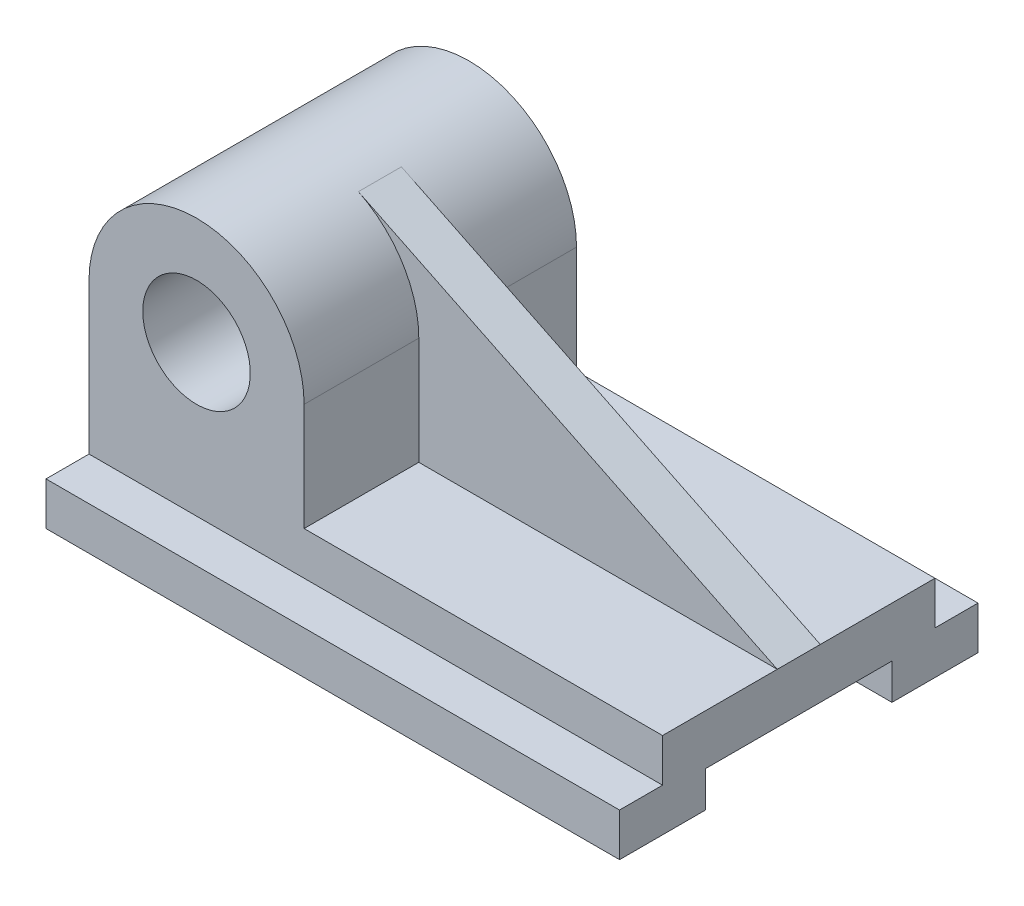
ISO-10303-21;
HEADER;
FILE_DESCRIPTION(('STEP AP214'),'2;1');
FILE_NAME('part.step','',(''),(''),'','','');
FILE_SCHEMA(('AUTOMOTIVE_DESIGN { 1 0 10303 214 1 1 1 1 }'));
ENDSEC;
DATA;
#1=APPLICATION_CONTEXT('core data for automotive mechanical design processes');
#2=APPLICATION_PROTOCOL_DEFINITION('international standard','automotive_design',2000,#1);
#3=PRODUCT_CONTEXT('',#1,'mechanical');
#4=PRODUCT('Part','Part','',(#3));
#5=PRODUCT_RELATED_PRODUCT_CATEGORY('part','',(#4));
#6=PRODUCT_DEFINITION_FORMATION('','',#4);
#7=PRODUCT_DEFINITION_CONTEXT('part definition',#1,'design');
#8=PRODUCT_DEFINITION('design','',#6,#7);
#9=PRODUCT_DEFINITION_SHAPE('','',#8);
#10=(LENGTH_UNIT() NAMED_UNIT(*) SI_UNIT(.MILLI.,.METRE.));
#11=(NAMED_UNIT(*) PLANE_ANGLE_UNIT() SI_UNIT($,.RADIAN.));
#12=(NAMED_UNIT(*) SI_UNIT($,.STERADIAN.) SOLID_ANGLE_UNIT());
#13=UNCERTAINTY_MEASURE_WITH_UNIT(LENGTH_MEASURE(1.E-05),#10,'distance_accuracy_value','');
#14=(GEOMETRIC_REPRESENTATION_CONTEXT(3) GLOBAL_UNCERTAINTY_ASSIGNED_CONTEXT((#13)) GLOBAL_UNIT_ASSIGNED_CONTEXT((#10,
#11,#12)) REPRESENTATION_CONTEXT('',''));
#15=CARTESIAN_POINT('',(0.,0.,0.));
#16=DIRECTION('',(0.,0.,1.));
#17=DIRECTION('',(1.,0.,0.));
#18=AXIS2_PLACEMENT_3D('',#15,#16,#17);
#19=CARTESIAN_POINT('',(-160.,19.,0.));
#20=DIRECTION('',(0.,-1.,0.));
#21=DIRECTION('',(0.,0.,-1.));
#22=AXIS2_PLACEMENT_3D('',#19,#20,#21);
#23=PLANE('',#22);
#24=DIRECTION('',(-1.,0.,0.));
#25=VECTOR('',#24,1.);
#26=CARTESIAN_POINT('',(-160.,19.,-6.));
#27=LINE('',#26,#25);
#28=CARTESIAN_POINT('',(0.,19.,-6.));
#29=VERTEX_POINT('',#28);
#30=CARTESIAN_POINT('',(-100.,19.,-6.));
#31=VERTEX_POINT('',#30);
#32=EDGE_CURVE('E203',#29,#31,#27,.T.);
#33=ORIENTED_EDGE('',*,*,#32,.F.);
#34=DIRECTION('',(0.,0.,-1.));
#35=VECTOR('',#34,1.);
#36=CARTESIAN_POINT('',(0.,19.,0.));
#37=LINE('',#36,#35);
#38=CARTESIAN_POINT('',(0.,19.,-38.));
#39=VERTEX_POINT('',#38);
#40=EDGE_CURVE('E209',#29,#39,#37,.T.);
#41=ORIENTED_EDGE('',*,*,#40,.T.);
#42=DIRECTION('',(1.,0.,0.));
#43=VECTOR('',#42,1.);
#44=CARTESIAN_POINT('',(-160.,19.,-38.));
#45=LINE('',#44,#43);
#46=CARTESIAN_POINT('',(-100.,19.,-38.));
#47=VERTEX_POINT('',#46);
#48=EDGE_CURVE('E251',#47,#39,#45,.T.);
#49=ORIENTED_EDGE('',*,*,#48,.F.);
#50=DIRECTION('',(0.,0.,-1.));
#51=VECTOR('',#50,1.);
#52=CARTESIAN_POINT('',(-100.,19.,38.));
#53=LINE('',#52,#51);
#54=EDGE_CURVE('E211',#31,#47,#53,.T.);
#55=ORIENTED_EDGE('',*,*,#54,.F.);
#56=EDGE_LOOP('',(#33,#41,#49,#55));
#57=FACE_BOUND('',#56,.T.);
#58=ADVANCED_FACE('F61',(#57),#23,.F.);
#59=CARTESIAN_POINT('',(-100.,19.,38.));
#60=DIRECTION('',(-1.,0.,0.));
#61=DIRECTION('',(0.,0.,1.));
#62=AXIS2_PLACEMENT_3D('',#59,#60,#61);
#63=PLANE('',#62);
#64=DIRECTION('',(0.,1.,0.));
#65=VECTOR('',#64,1.);
#66=CARTESIAN_POINT('',(-100.,19.,-6.));
#67=LINE('',#66,#65);
#68=CARTESIAN_POINT('',(-100.,49.,-6.));
#69=VERTEX_POINT('',#68);
#70=EDGE_CURVE('E76',#31,#69,#67,.T.);
#71=ORIENTED_EDGE('',*,*,#70,.F.);
#72=ORIENTED_EDGE('',*,*,#54,.T.);
#73=DIRECTION('',(0.,1.,0.));
#74=VECTOR('',#73,1.);
#75=CARTESIAN_POINT('',(-100.,19.,-38.));
#76=LINE('',#75,#74);
#77=CARTESIAN_POINT('',(-100.,49.,-38.));
#78=VERTEX_POINT('',#77);
#79=EDGE_CURVE('E392',#47,#78,#76,.T.);
#80=ORIENTED_EDGE('',*,*,#79,.T.);
#81=DIRECTION('',(0.,0.,-1.));
#82=VECTOR('',#81,1.);
#83=CARTESIAN_POINT('',(-100.,49.,38.));
#84=LINE('',#83,#82);
#85=EDGE_CURVE('E352',#69,#78,#84,.T.);
#86=ORIENTED_EDGE('',*,*,#85,.F.);
#87=EDGE_LOOP('',(#71,#72,#80,#86));
#88=FACE_BOUND('',#87,.T.);
#89=ADVANCED_FACE('F371',(#88),#63,.F.);
#90=CARTESIAN_POINT('',(0.,19.,38.));
#91=VERTEX_POINT('',#90);
#92=CARTESIAN_POINT('',(0.,19.,6.));
#93=VERTEX_POINT('',#92);
#94=EDGE_CURVE('E218',#91,#93,#37,.T.);
#95=ORIENTED_EDGE('',*,*,#94,.T.);
#96=DIRECTION('',(-1.,0.,0.));
#97=VECTOR('',#96,1.);
#98=CARTESIAN_POINT('',(-160.,19.,6.));
#99=LINE('',#98,#97);
#100=CARTESIAN_POINT('',(-100.,19.,6.));
#101=VERTEX_POINT('',#100);
#102=EDGE_CURVE('E199',#93,#101,#99,.T.);
#103=ORIENTED_EDGE('',*,*,#102,.T.);
#104=CARTESIAN_POINT('',(-100.,19.,38.));
#105=VERTEX_POINT('',#104);
#106=EDGE_CURVE('E84',#105,#101,#53,.T.);
#107=ORIENTED_EDGE('',*,*,#106,.F.);
#108=DIRECTION('',(1.,0.,0.));
#109=VECTOR('',#108,1.);
#110=CARTESIAN_POINT('',(-160.,19.,38.));
#111=LINE('',#110,#109);
#112=EDGE_CURVE('E249',#105,#91,#111,.T.);
#113=ORIENTED_EDGE('',*,*,#112,.T.);
#114=EDGE_LOOP('',(#95,#103,#107,#113));
#115=FACE_BOUND('',#114,.T.);
#116=ADVANCED_FACE('F373',(#115),#23,.F.);
#117=CARTESIAN_POINT('',(-160.,5.,0.));
#118=DIRECTION('',(0.,-1.,0.));
#119=DIRECTION('',(0.,0.,-1.));
#120=AXIS2_PLACEMENT_3D('',#117,#118,#119);
#121=PLANE('',#120);
#122=DIRECTION('',(0.,0.,-1.));
#123=VECTOR('',#122,1.);
#124=CARTESIAN_POINT('',(-160.,5.,0.));
#125=LINE('',#124,#123);
#126=CARTESIAN_POINT('',(-160.,5.,26.));
#127=VERTEX_POINT('',#126);
#128=CARTESIAN_POINT('',(-160.,5.,-26.));
#129=VERTEX_POINT('',#128);
#130=EDGE_CURVE('E235',#127,#129,#125,.T.);
#131=ORIENTED_EDGE('',*,*,#130,.T.);
#132=DIRECTION('',(1.,0.,0.));
#133=VECTOR('',#132,1.);
#134=CARTESIAN_POINT('',(-160.,5.,-26.));
#135=LINE('',#134,#133);
#136=CARTESIAN_POINT('',(0.,5.,-26.));
#137=VERTEX_POINT('',#136);
#138=EDGE_CURVE('E263',#129,#137,#135,.T.);
#139=ORIENTED_EDGE('',*,*,#138,.T.);
#140=DIRECTION('',(0.,0.,-1.));
#141=VECTOR('',#140,1.);
#142=CARTESIAN_POINT('',(0.,5.,0.));
#143=LINE('',#142,#141);
#144=CARTESIAN_POINT('',(0.,5.,26.));
#145=VERTEX_POINT('',#144);
#146=EDGE_CURVE('E280',#145,#137,#143,.T.);
#147=ORIENTED_EDGE('',*,*,#146,.F.);
#148=DIRECTION('',(1.,0.,0.));
#149=VECTOR('',#148,1.);
#150=CARTESIAN_POINT('',(-160.,5.,26.));
#151=LINE('',#150,#149);
#152=EDGE_CURVE('E69',#127,#145,#151,.T.);
#153=ORIENTED_EDGE('',*,*,#152,.F.);
#154=EDGE_LOOP('',(#131,#139,#147,#153));
#155=FACE_BOUND('',#154,.T.);
#156=ADVANCED_FACE('F63',(#155),#121,.T.);
#157=CARTESIAN_POINT('',(-160.,0.,26.));
#158=DIRECTION('',(0.,0.,1.));
#159=DIRECTION('',(1.,0.,0.));
#160=AXIS2_PLACEMENT_3D('',#157,#158,#159);
#161=PLANE('',#160);
#162=DIRECTION('',(0.,-1.,0.));
#163=VECTOR('',#162,1.);
#164=CARTESIAN_POINT('',(0.,0.,26.));
#165=LINE('',#164,#163);
#166=CARTESIAN_POINT('',(0.,-5.,26.));
#167=VERTEX_POINT('',#166);
#168=EDGE_CURVE('E233',#145,#167,#165,.T.);
#169=ORIENTED_EDGE('',*,*,#168,.T.);
#170=DIRECTION('',(1.,0.,0.));
#171=VECTOR('',#170,1.);
#172=CARTESIAN_POINT('',(-160.,-5.,26.));
#173=LINE('',#172,#171);
#174=CARTESIAN_POINT('',(-160.,-5.,26.));
#175=VERTEX_POINT('',#174);
#176=EDGE_CURVE('E237',#175,#167,#173,.T.);
#177=ORIENTED_EDGE('',*,*,#176,.F.);
#178=DIRECTION('',(0.,-1.,0.));
#179=VECTOR('',#178,1.);
#180=CARTESIAN_POINT('',(-160.,0.,26.));
#181=LINE('',#180,#179);
#182=EDGE_CURVE('E265',#127,#175,#181,.T.);
#183=ORIENTED_EDGE('',*,*,#182,.F.);
#184=ORIENTED_EDGE('',*,*,#152,.T.);
#185=EDGE_LOOP('',(#169,#177,#183,#184));
#186=FACE_BOUND('',#185,.T.);
#187=ADVANCED_FACE('F386',(#186),#161,.F.);
#188=CARTESIAN_POINT('',(-160.,-5.,0.));
#189=DIRECTION('',(0.,1.,0.));
#190=DIRECTION('',(0.,0.,1.));
#191=AXIS2_PLACEMENT_3D('',#188,#189,#190);
#192=PLANE('',#191);
#193=DIRECTION('',(0.,0.,1.));
#194=VECTOR('',#193,1.);
#195=CARTESIAN_POINT('',(0.,-5.,0.));
#196=LINE('',#195,#194);
#197=CARTESIAN_POINT('',(0.,-5.00000000000001,50.));
#198=VERTEX_POINT('',#197);
#199=EDGE_CURVE('E231',#167,#198,#196,.T.);
#200=ORIENTED_EDGE('',*,*,#199,.T.);
#201=DIRECTION('',(1.,0.,0.));
#202=VECTOR('',#201,1.);
#203=CARTESIAN_POINT('',(-160.,-5.00000000000001,50.));
#204=LINE('',#203,#202);
#205=CARTESIAN_POINT('',(-160.,-5.00000000000001,50.));
#206=VERTEX_POINT('',#205);
#207=EDGE_CURVE('E240',#206,#198,#204,.T.);
#208=ORIENTED_EDGE('',*,*,#207,.F.);
#209=DIRECTION('',(0.,0.,1.));
#210=VECTOR('',#209,1.);
#211=CARTESIAN_POINT('',(-160.,-5.,0.));
#212=LINE('',#211,#210);
#213=EDGE_CURVE('E270',#175,#206,#212,.T.);
#214=ORIENTED_EDGE('',*,*,#213,.F.);
#215=ORIENTED_EDGE('',*,*,#176,.T.);
#216=EDGE_LOOP('',(#200,#208,#214,#215));
#217=FACE_BOUND('',#216,.T.);
#218=ADVANCED_FACE('F434',(#217),#192,.F.);
#219=CARTESIAN_POINT('',(-160.,0.,50.));
#220=DIRECTION('',(0.,0.,-1.));
#221=DIRECTION('',(-1.,0.,0.));
#222=AXIS2_PLACEMENT_3D('',#219,#220,#221);
#223=PLANE('',#222);
#224=DIRECTION('',(0.,1.,0.));
#225=VECTOR('',#224,1.);
#226=CARTESIAN_POINT('',(0.,0.,50.));
#227=LINE('',#226,#225);
#228=CARTESIAN_POINT('',(0.,6.99999999999999,50.));
#229=VERTEX_POINT('',#228);
#230=EDGE_CURVE('E229',#198,#229,#227,.T.);
#231=ORIENTED_EDGE('',*,*,#230,.T.);
#232=DIRECTION('',(1.,0.,0.));
#233=VECTOR('',#232,1.);
#234=CARTESIAN_POINT('',(-160.,6.99999999999999,50.));
#235=LINE('',#234,#233);
#236=CARTESIAN_POINT('',(-160.,6.99999999999999,50.));
#237=VERTEX_POINT('',#236);
#238=EDGE_CURVE('E243',#237,#229,#235,.T.);
#239=ORIENTED_EDGE('',*,*,#238,.F.);
#240=DIRECTION('',(0.,1.,0.));
#241=VECTOR('',#240,1.);
#242=CARTESIAN_POINT('',(-160.,0.,50.));
#243=LINE('',#242,#241);
#244=EDGE_CURVE('E276',#206,#237,#243,.T.);
#245=ORIENTED_EDGE('',*,*,#244,.F.);
#246=ORIENTED_EDGE('',*,*,#207,.T.);
#247=EDGE_LOOP('',(#231,#239,#245,#246));
#248=FACE_BOUND('',#247,.T.);
#249=ADVANCED_FACE('F329',(#248),#223,.F.);
#250=CARTESIAN_POINT('',(-160.,6.99999999999999,0.));
#251=DIRECTION('',(0.,-1.,0.));
#252=DIRECTION('',(0.,0.,-1.));
#253=AXIS2_PLACEMENT_3D('',#250,#251,#252);
#254=PLANE('',#253);
#255=DIRECTION('',(0.,0.,-1.));
#256=VECTOR('',#255,1.);
#257=CARTESIAN_POINT('',(0.,6.99999999999999,0.));
#258=LINE('',#257,#256);
#259=CARTESIAN_POINT('',(0.,6.99999999999999,38.));
#260=VERTEX_POINT('',#259);
#261=EDGE_CURVE('E227',#229,#260,#258,.T.);
#262=ORIENTED_EDGE('',*,*,#261,.T.);
#263=DIRECTION('',(1.,0.,0.));
#264=VECTOR('',#263,1.);
#265=CARTESIAN_POINT('',(-160.,6.99999999999999,38.));
#266=LINE('',#265,#264);
#267=CARTESIAN_POINT('',(-160.,6.99999999999999,38.));
#268=VERTEX_POINT('',#267);
#269=EDGE_CURVE('E246',#268,#260,#266,.T.);
#270=ORIENTED_EDGE('',*,*,#269,.F.);
#271=DIRECTION('',(0.,0.,-1.));
#272=VECTOR('',#271,1.);
#273=CARTESIAN_POINT('',(-160.,6.99999999999999,0.));
#274=LINE('',#273,#272);
#275=EDGE_CURVE('E320',#237,#268,#274,.T.);
#276=ORIENTED_EDGE('',*,*,#275,.F.);
#277=ORIENTED_EDGE('',*,*,#238,.T.);
#278=EDGE_LOOP('',(#262,#270,#276,#277));
#279=FACE_BOUND('',#278,.T.);
#280=ADVANCED_FACE('F333',(#279),#254,.F.);
#281=CARTESIAN_POINT('',(-160.,0.,38.));
#282=DIRECTION('',(0.,0.,-1.));
#283=DIRECTION('',(-1.,0.,0.));
#284=AXIS2_PLACEMENT_3D('',#281,#282,#283);
#285=PLANE('',#284);
#286=DIRECTION('',(0.,1.,0.));
#287=VECTOR('',#286,1.);
#288=CARTESIAN_POINT('',(0.,0.,38.));
#289=LINE('',#288,#287);
#290=EDGE_CURVE('E220',#260,#91,#289,.T.);
#291=ORIENTED_EDGE('',*,*,#290,.T.);
#292=ORIENTED_EDGE('',*,*,#112,.F.);
#293=DIRECTION('',(0.,1.,0.));
#294=VECTOR('',#293,1.);
#295=CARTESIAN_POINT('',(-100.,19.,38.));
#296=LINE('',#295,#294);
#297=CARTESIAN_POINT('',(-100.,49.,38.));
#298=VERTEX_POINT('',#297);
#299=EDGE_CURVE('E356',#105,#298,#296,.T.);
#300=ORIENTED_EDGE('',*,*,#299,.T.);
#301=CARTESIAN_POINT('',(-130.,49.,38.));
#302=DIRECTION('',(0.,0.,-1.));
#303=DIRECTION('',(-1.,0.,0.));
#304=AXIS2_PLACEMENT_3D('',#301,#302,#303);
#305=CIRCLE('',#304,30.);
#306=CARTESIAN_POINT('',(-160.,49.,38.));
#307=VERTEX_POINT('',#306);
#308=EDGE_CURVE('E341',#307,#298,#305,.T.);
#309=ORIENTED_EDGE('',*,*,#308,.F.);
#310=DIRECTION('',(0.,1.,0.));
#311=VECTOR('',#310,1.);
#312=CARTESIAN_POINT('',(-160.,0.,38.));
#313=LINE('',#312,#311);
#314=EDGE_CURVE('E318',#268,#307,#313,.T.);
#315=ORIENTED_EDGE('',*,*,#314,.F.);
#316=ORIENTED_EDGE('',*,*,#269,.T.);
#317=EDGE_LOOP('',(#291,#292,#300,#309,#315,#316));
#318=FACE_BOUND('',#317,.T.);
#319=CARTESIAN_POINT('',(-130.,49.,38.));
#320=DIRECTION('',(0.,0.,-1.));
#321=DIRECTION('',(-1.,0.,0.));
#322=AXIS2_PLACEMENT_3D('',#319,#320,#321);
#323=CIRCLE('',#322,15.);
#324=CARTESIAN_POINT('',(-145.,49.,38.));
#325=VERTEX_POINT('',#324);
#326=EDGE_CURVE('E396',#325,#325,#323,.T.);
#327=ORIENTED_EDGE('',*,*,#326,.T.);
#328=EDGE_LOOP('',(#327));
#329=FACE_BOUND('',#328,.T.);
#330=ADVANCED_FACE('F338',(#318,#329),#285,.F.);
#331=CARTESIAN_POINT('',(-160.,0.,-38.));
#332=DIRECTION('',(0.,0.,1.));
#333=DIRECTION('',(1.,0.,0.));
#334=AXIS2_PLACEMENT_3D('',#331,#332,#333);
#335=PLANE('',#334);
#336=DIRECTION('',(0.,-1.,0.));
#337=VECTOR('',#336,1.);
#338=CARTESIAN_POINT('',(0.,0.,-38.));
#339=LINE('',#338,#337);
#340=CARTESIAN_POINT('',(0.,7.,-38.));
#341=VERTEX_POINT('',#340);
#342=EDGE_CURVE('E217',#39,#341,#339,.T.);
#343=ORIENTED_EDGE('',*,*,#342,.T.);
#344=DIRECTION('',(1.,0.,0.));
#345=VECTOR('',#344,1.);
#346=CARTESIAN_POINT('',(-160.,7.,-38.));
#347=LINE('',#346,#345);
#348=CARTESIAN_POINT('',(-160.,7.,-38.));
#349=VERTEX_POINT('',#348);
#350=EDGE_CURVE('E253',#349,#341,#347,.T.);
#351=ORIENTED_EDGE('',*,*,#350,.F.);
#352=DIRECTION('',(0.,-1.,0.));
#353=VECTOR('',#352,1.);
#354=CARTESIAN_POINT('',(-160.,0.,-38.));
#355=LINE('',#354,#353);
#356=CARTESIAN_POINT('',(-160.,49.,-38.));
#357=VERTEX_POINT('',#356);
#358=EDGE_CURVE('E316',#357,#349,#355,.T.);
#359=ORIENTED_EDGE('',*,*,#358,.F.);
#360=CARTESIAN_POINT('',(-130.,49.,-38.));
#361=DIRECTION('',(0.,0.,-1.));
#362=DIRECTION('',(-1.,0.,0.));
#363=AXIS2_PLACEMENT_3D('',#360,#361,#362);
#364=CIRCLE('',#363,30.);
#365=EDGE_CURVE('E351',#357,#78,#364,.T.);
#366=ORIENTED_EDGE('',*,*,#365,.T.);
#367=ORIENTED_EDGE('',*,*,#79,.F.);
#368=ORIENTED_EDGE('',*,*,#48,.T.);
#369=EDGE_LOOP('',(#343,#351,#359,#366,#367,#368));
#370=FACE_BOUND('',#369,.T.);
#371=CARTESIAN_POINT('',(-130.,49.,-38.));
#372=DIRECTION('',(0.,0.,-1.));
#373=DIRECTION('',(-1.,0.,0.));
#374=AXIS2_PLACEMENT_3D('',#371,#372,#373);
#375=CIRCLE('',#374,15.);
#376=CARTESIAN_POINT('',(-145.,49.,-38.));
#377=VERTEX_POINT('',#376);
#378=EDGE_CURVE('E198',#377,#377,#375,.T.);
#379=ORIENTED_EDGE('',*,*,#378,.F.);
#380=EDGE_LOOP('',(#379));
#381=FACE_BOUND('',#380,.T.);
#382=ADVANCED_FACE('F412',(#370,#381),#335,.F.);
#383=CARTESIAN_POINT('',(-160.,7.,0.));
#384=DIRECTION('',(0.,-1.,0.));
#385=DIRECTION('',(0.,0.,-1.));
#386=AXIS2_PLACEMENT_3D('',#383,#384,#385);
#387=PLANE('',#386);
#388=DIRECTION('',(0.,0.,-1.));
#389=VECTOR('',#388,1.);
#390=CARTESIAN_POINT('',(0.,7.,0.));
#391=LINE('',#390,#389);
#392=CARTESIAN_POINT('',(0.,7.,-50.));
#393=VERTEX_POINT('',#392);
#394=EDGE_CURVE('E221',#341,#393,#391,.T.);
#395=ORIENTED_EDGE('',*,*,#394,.T.);
#396=DIRECTION('',(1.,0.,0.));
#397=VECTOR('',#396,1.);
#398=CARTESIAN_POINT('',(-160.,7.,-50.));
#399=LINE('',#398,#397);
#400=CARTESIAN_POINT('',(-160.,7.,-50.));
#401=VERTEX_POINT('',#400);
#402=EDGE_CURVE('E256',#401,#393,#399,.T.);
#403=ORIENTED_EDGE('',*,*,#402,.F.);
#404=DIRECTION('',(0.,0.,-1.));
#405=VECTOR('',#404,1.);
#406=CARTESIAN_POINT('',(-160.,7.,0.));
#407=LINE('',#406,#405);
#408=EDGE_CURVE('E310',#349,#401,#407,.T.);
#409=ORIENTED_EDGE('',*,*,#408,.F.);
#410=ORIENTED_EDGE('',*,*,#350,.T.);
#411=EDGE_LOOP('',(#395,#403,#409,#410));
#412=FACE_BOUND('',#411,.T.);
#413=ADVANCED_FACE('F291',(#412),#387,.F.);
#414=CARTESIAN_POINT('',(-160.,0.,-50.));
#415=DIRECTION('',(0.,0.,1.));
#416=DIRECTION('',(1.,0.,0.));
#417=AXIS2_PLACEMENT_3D('',#414,#415,#416);
#418=PLANE('',#417);
#419=DIRECTION('',(0.,-1.,0.));
#420=VECTOR('',#419,1.);
#421=CARTESIAN_POINT('',(0.,0.,-50.));
#422=LINE('',#421,#420);
#423=CARTESIAN_POINT('',(0.,-5.,-50.));
#424=VERTEX_POINT('',#423);
#425=EDGE_CURVE('E288',#393,#424,#422,.T.);
#426=ORIENTED_EDGE('',*,*,#425,.T.);
#427=DIRECTION('',(1.,0.,0.));
#428=VECTOR('',#427,1.);
#429=CARTESIAN_POINT('',(-160.,-5.,-50.));
#430=LINE('',#429,#428);
#431=CARTESIAN_POINT('',(-160.,-5.,-50.));
#432=VERTEX_POINT('',#431);
#433=EDGE_CURVE('E259',#432,#424,#430,.T.);
#434=ORIENTED_EDGE('',*,*,#433,.F.);
#435=DIRECTION('',(0.,-1.,0.));
#436=VECTOR('',#435,1.);
#437=CARTESIAN_POINT('',(-160.,0.,-50.));
#438=LINE('',#437,#436);
#439=EDGE_CURVE('E299',#401,#432,#438,.T.);
#440=ORIENTED_EDGE('',*,*,#439,.F.);
#441=ORIENTED_EDGE('',*,*,#402,.T.);
#442=EDGE_LOOP('',(#426,#434,#440,#441));
#443=FACE_BOUND('',#442,.T.);
#444=ADVANCED_FACE('F297',(#443),#418,.F.);
#445=CARTESIAN_POINT('',(-160.,-5.,0.));
#446=DIRECTION('',(0.,1.,0.));
#447=DIRECTION('',(0.,0.,1.));
#448=AXIS2_PLACEMENT_3D('',#445,#446,#447);
#449=PLANE('',#448);
#450=DIRECTION('',(0.,0.,1.));
#451=VECTOR('',#450,1.);
#452=CARTESIAN_POINT('',(0.,-5.,0.));
#453=LINE('',#452,#451);
#454=CARTESIAN_POINT('',(0.,-5.,-26.));
#455=VERTEX_POINT('',#454);
#456=EDGE_CURVE('E285',#424,#455,#453,.T.);
#457=ORIENTED_EDGE('',*,*,#456,.T.);
#458=DIRECTION('',(1.,0.,0.));
#459=VECTOR('',#458,1.);
#460=CARTESIAN_POINT('',(-160.,-5.,-26.));
#461=LINE('',#460,#459);
#462=CARTESIAN_POINT('',(-160.,-5.,-26.));
#463=VERTEX_POINT('',#462);
#464=EDGE_CURVE('E262',#463,#455,#461,.T.);
#465=ORIENTED_EDGE('',*,*,#464,.F.);
#466=DIRECTION('',(0.,0.,1.));
#467=VECTOR('',#466,1.);
#468=CARTESIAN_POINT('',(-160.,-5.,0.));
#469=LINE('',#468,#467);
#470=EDGE_CURVE('E306',#432,#463,#469,.T.);
#471=ORIENTED_EDGE('',*,*,#470,.F.);
#472=ORIENTED_EDGE('',*,*,#433,.T.);
#473=EDGE_LOOP('',(#457,#465,#471,#472));
#474=FACE_BOUND('',#473,.T.);
#475=ADVANCED_FACE('F303',(#474),#449,.F.);
#476=CARTESIAN_POINT('',(-160.,0.,-26.));
#477=DIRECTION('',(0.,0.,1.));
#478=DIRECTION('',(0.,-1.,0.));
#479=AXIS2_PLACEMENT_3D('',#476,#477,#478);
#480=PLANE('',#479);
#481=DIRECTION('',(0.,-1.,0.));
#482=VECTOR('',#481,1.);
#483=CARTESIAN_POINT('',(0.,0.,-26.));
#484=LINE('',#483,#482);
#485=EDGE_CURVE('E282',#137,#455,#484,.T.);
#486=ORIENTED_EDGE('',*,*,#485,.F.);
#487=ORIENTED_EDGE('',*,*,#138,.F.);
#488=DIRECTION('',(0.,-1.,0.));
#489=VECTOR('',#488,1.);
#490=CARTESIAN_POINT('',(-160.,0.,-26.));
#491=LINE('',#490,#489);
#492=EDGE_CURVE('E308',#129,#463,#491,.T.);
#493=ORIENTED_EDGE('',*,*,#492,.T.);
#494=ORIENTED_EDGE('',*,*,#464,.T.);
#495=EDGE_LOOP('',(#486,#487,#493,#494));
#496=FACE_BOUND('',#495,.T.);
#497=ADVANCED_FACE('F362',(#496),#480,.T.);
#498=CARTESIAN_POINT('',(-160.,0.,0.));
#499=DIRECTION('',(1.,0.,0.));
#500=DIRECTION('',(0.,0.,-1.));
#501=AXIS2_PLACEMENT_3D('',#498,#499,#500);
#502=PLANE('',#501);
#503=DIRECTION('',(0.,0.,-1.));
#504=VECTOR('',#503,1.);
#505=CARTESIAN_POINT('',(-160.,49.,38.));
#506=LINE('',#505,#504);
#507=EDGE_CURVE('E343',#307,#357,#506,.T.);
#508=ORIENTED_EDGE('',*,*,#507,.T.);
#509=ORIENTED_EDGE('',*,*,#358,.T.);
#510=ORIENTED_EDGE('',*,*,#408,.T.);
#511=ORIENTED_EDGE('',*,*,#439,.T.);
#512=ORIENTED_EDGE('',*,*,#470,.T.);
#513=ORIENTED_EDGE('',*,*,#492,.F.);
#514=ORIENTED_EDGE('',*,*,#130,.F.);
#515=ORIENTED_EDGE('',*,*,#182,.T.);
#516=ORIENTED_EDGE('',*,*,#213,.T.);
#517=ORIENTED_EDGE('',*,*,#244,.T.);
#518=ORIENTED_EDGE('',*,*,#275,.T.);
#519=ORIENTED_EDGE('',*,*,#314,.T.);
#520=EDGE_LOOP('',(#508,#509,#510,#511,#512,#513,#514,#515,#516,#517,#518,#519));
#521=FACE_BOUND('',#520,.T.);
#522=ADVANCED_FACE('F323',(#521),#502,.F.);
#523=CARTESIAN_POINT('',(0.,0.,0.));
#524=DIRECTION('',(1.,0.,0.));
#525=DIRECTION('',(0.,0.,-1.));
#526=AXIS2_PLACEMENT_3D('',#523,#524,#525);
#527=PLANE('',#526);
#528=ORIENTED_EDGE('',*,*,#146,.T.);
#529=ORIENTED_EDGE('',*,*,#485,.T.);
#530=ORIENTED_EDGE('',*,*,#456,.F.);
#531=ORIENTED_EDGE('',*,*,#425,.F.);
#532=ORIENTED_EDGE('',*,*,#394,.F.);
#533=ORIENTED_EDGE('',*,*,#342,.F.);
#534=ORIENTED_EDGE('',*,*,#40,.F.);
#535=DIRECTION('',(0.,0.,1.));
#536=VECTOR('',#535,1.);
#537=CARTESIAN_POINT('',(0.,19.,0.));
#538=LINE('',#537,#536);
#539=EDGE_CURVE('E187',#29,#93,#538,.T.);
#540=ORIENTED_EDGE('',*,*,#539,.T.);
#541=ORIENTED_EDGE('',*,*,#94,.F.);
#542=ORIENTED_EDGE('',*,*,#290,.F.);
#543=ORIENTED_EDGE('',*,*,#261,.F.);
#544=ORIENTED_EDGE('',*,*,#230,.F.);
#545=ORIENTED_EDGE('',*,*,#199,.F.);
#546=ORIENTED_EDGE('',*,*,#168,.F.);
#547=EDGE_LOOP('',(#528,#529,#530,#531,#532,#533,#534,#540,#541,#542,#543,#544,#545,#546));
#548=FACE_BOUND('',#547,.T.);
#549=ADVANCED_FACE('F215',(#548),#527,.T.);
#550=ORIENTED_EDGE('',*,*,#106,.T.);
#551=DIRECTION('',(0.,1.,0.));
#552=VECTOR('',#551,1.);
#553=CARTESIAN_POINT('',(-100.,19.,6.));
#554=LINE('',#553,#552);
#555=CARTESIAN_POINT('',(-100.,49.,6.));
#556=VERTEX_POINT('',#555);
#557=EDGE_CURVE('E404',#101,#556,#554,.T.);
#558=ORIENTED_EDGE('',*,*,#557,.T.);
#559=EDGE_CURVE('E354',#298,#556,#84,.T.);
#560=ORIENTED_EDGE('',*,*,#559,.F.);
#561=ORIENTED_EDGE('',*,*,#299,.F.);
#562=EDGE_LOOP('',(#550,#558,#560,#561));
#563=FACE_BOUND('',#562,.T.);
#564=ADVANCED_FACE('F379',(#563),#63,.F.);
#565=CARTESIAN_POINT('',(-130.,49.,38.));
#566=DIRECTION('',(0.,0.,-1.));
#567=DIRECTION('',(-1.,0.,0.));
#568=AXIS2_PLACEMENT_3D('',#565,#566,#567);
#569=CYLINDRICAL_SURFACE('',#568,30.);
#570=CARTESIAN_POINT('',(-130.,49.,6.));
#571=DIRECTION('',(0.,0.,1.));
#572=DIRECTION('',(1.,0.,0.));
#573=AXIS2_PLACEMENT_3D('',#570,#571,#572);
#574=CIRCLE('',#573,30.);
#575=CARTESIAN_POINT('',(-116.85393258427,75.9662921348314,6.));
#576=VERTEX_POINT('',#575);
#577=EDGE_CURVE('E212',#576,#556,#574,.F.);
#578=ORIENTED_EDGE('',*,*,#577,.F.);
#579=DIRECTION('',(0.,0.,-1.));
#580=VECTOR('',#579,1.);
#581=CARTESIAN_POINT('',(-116.85393258427,75.9662921348314,38.));
#582=LINE('',#581,#580);
#583=CARTESIAN_POINT('',(-116.85393258427,75.9662921348314,-6.));
#584=VERTEX_POINT('',#583);
#585=EDGE_CURVE('E14',#584,#576,#582,.F.);
#586=ORIENTED_EDGE('',*,*,#585,.F.);
#587=CARTESIAN_POINT('',(-130.,49.,-6.));
#588=DIRECTION('',(0.,0.,1.));
#589=DIRECTION('',(1.,0.,0.));
#590=AXIS2_PLACEMENT_3D('',#587,#588,#589);
#591=CIRCLE('',#590,30.);
#592=EDGE_CURVE('E204',#584,#69,#591,.F.);
#593=ORIENTED_EDGE('',*,*,#592,.T.);
#594=ORIENTED_EDGE('',*,*,#85,.T.);
#595=ORIENTED_EDGE('',*,*,#365,.F.);
#596=ORIENTED_EDGE('',*,*,#507,.F.);
#597=ORIENTED_EDGE('',*,*,#308,.T.);
#598=ORIENTED_EDGE('',*,*,#559,.T.);
#599=EDGE_LOOP('',(#578,#586,#593,#594,#595,#596,#597,#598));
#600=FACE_BOUND('',#599,.T.);
#601=ADVANCED_FACE('F348',(#600),#569,.T.);
#602=CARTESIAN_POINT('',(-130.,49.,38.));
#603=DIRECTION('',(0.,0.,-1.));
#604=DIRECTION('',(-1.,0.,0.));
#605=AXIS2_PLACEMENT_3D('',#602,#603,#604);
#606=CYLINDRICAL_SURFACE('',#605,15.);
#607=ORIENTED_EDGE('',*,*,#326,.F.);
#608=EDGE_LOOP('',(#607));
#609=FACE_BOUND('',#608,.T.);
#610=ORIENTED_EDGE('',*,*,#378,.T.);
#611=EDGE_LOOP('',(#610));
#612=FACE_BOUND('',#611,.T.);
#613=ADVANCED_FACE('F417',(#609,#612),#606,.F.);
#614=CARTESIAN_POINT('',(0.,19.,0.));
#615=DIRECTION('',(0.438202247191011,0.898876404494382,0.));
#616=DIRECTION('',(-0.898876404494382,0.438202247191011,0.));
#617=AXIS2_PLACEMENT_3D('',#614,#615,#616);
#618=PLANE('',#617);
#619=ORIENTED_EDGE('',*,*,#539,.F.);
#620=DIRECTION('',(-0.898876404494382,0.438202247191011,0.));
#621=VECTOR('',#620,1.);
#622=CARTESIAN_POINT('',(0.,19.,-6.));
#623=LINE('',#622,#621);
#624=EDGE_CURVE('E190',#29,#584,#623,.T.);
#625=ORIENTED_EDGE('',*,*,#624,.T.);
#626=ORIENTED_EDGE('',*,*,#585,.T.);
#627=DIRECTION('',(-0.898876404494382,0.438202247191011,0.));
#628=VECTOR('',#627,1.);
#629=CARTESIAN_POINT('',(0.,19.,6.));
#630=LINE('',#629,#628);
#631=EDGE_CURVE('E193',#93,#576,#630,.T.);
#632=ORIENTED_EDGE('',*,*,#631,.F.);
#633=EDGE_LOOP('',(#619,#625,#626,#632));
#634=FACE_BOUND('',#633,.T.);
#635=ADVANCED_FACE('F189',(#634),#618,.T.);
#636=CARTESIAN_POINT('',(-80.,37.,6.));
#637=DIRECTION('',(0.,0.,1.));
#638=DIRECTION('',(1.,0.,0.));
#639=AXIS2_PLACEMENT_3D('',#636,#637,#638);
#640=PLANE('',#639);
#641=ORIENTED_EDGE('',*,*,#102,.F.);
#642=ORIENTED_EDGE('',*,*,#631,.T.);
#643=ORIENTED_EDGE('',*,*,#577,.T.);
#644=ORIENTED_EDGE('',*,*,#557,.F.);
#645=EDGE_LOOP('',(#641,#642,#643,#644));
#646=FACE_BOUND('',#645,.T.);
#647=ADVANCED_FACE('F410',(#646),#640,.T.);
#648=CARTESIAN_POINT('',(-80.,37.,-6.));
#649=DIRECTION('',(0.,0.,1.));
#650=DIRECTION('',(1.,0.,0.));
#651=AXIS2_PLACEMENT_3D('',#648,#649,#650);
#652=PLANE('',#651);
#653=ORIENTED_EDGE('',*,*,#624,.F.);
#654=ORIENTED_EDGE('',*,*,#32,.T.);
#655=ORIENTED_EDGE('',*,*,#70,.T.);
#656=ORIENTED_EDGE('',*,*,#592,.F.);
#657=EDGE_LOOP('',(#653,#654,#655,#656));
#658=FACE_BOUND('',#657,.T.);
#659=ADVANCED_FACE('F202',(#658),#652,.F.);
#660=CLOSED_SHELL('',(#58,#89,#116,#156,#187,#218,#249,#280,#330,#382,#413,#444,#475,#497,#522,
#549,#564,#601,#613,#635,#647,#659));
#661=MANIFOLD_SOLID_BREP('B2',#660);
#662=ADVANCED_BREP_SHAPE_REPRESENTATION('',(#18,#661),#14);
#663=SHAPE_DEFINITION_REPRESENTATION(#9,#662);
ENDSEC;
END-ISO-10303-21;
